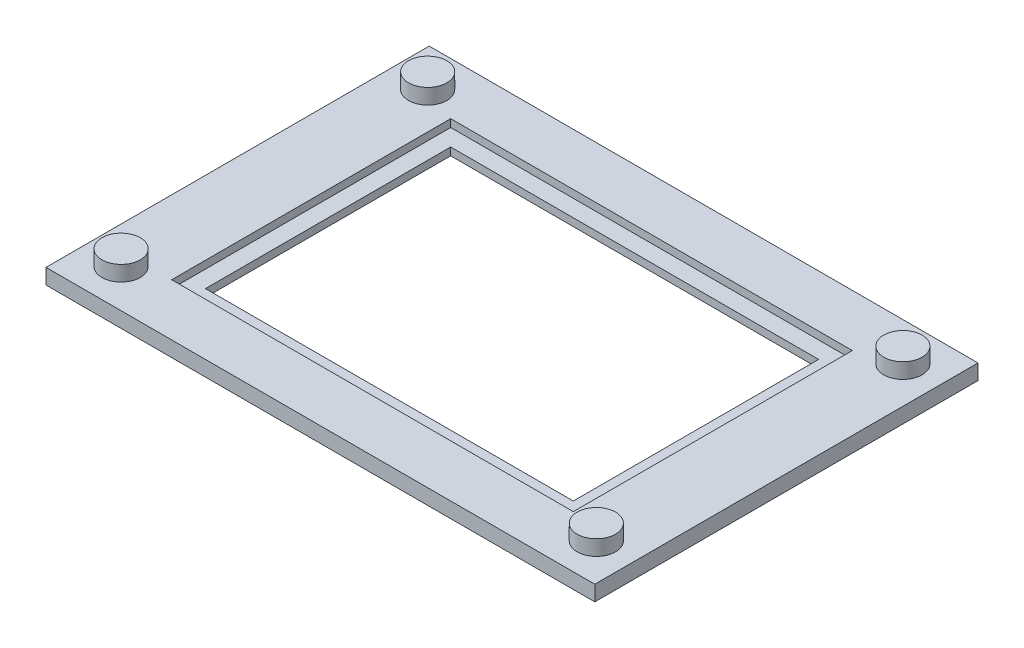
ISO-10303-21;
HEADER;
FILE_DESCRIPTION(('STEP AP214'),'2;1');
FILE_NAME('part.step','',(''),(''),'','','');
FILE_SCHEMA(('AUTOMOTIVE_DESIGN { 1 0 10303 214 1 1 1 1 }'));
ENDSEC;
DATA;
#1=APPLICATION_CONTEXT('core data for automotive mechanical design processes');
#2=APPLICATION_PROTOCOL_DEFINITION('international standard','automotive_design',2000,#1);
#3=PRODUCT_CONTEXT('',#1,'mechanical');
#4=PRODUCT('Part','Part','',(#3));
#5=PRODUCT_RELATED_PRODUCT_CATEGORY('part','',(#4));
#6=PRODUCT_DEFINITION_FORMATION('','',#4);
#7=PRODUCT_DEFINITION_CONTEXT('part definition',#1,'design');
#8=PRODUCT_DEFINITION('design','',#6,#7);
#9=PRODUCT_DEFINITION_SHAPE('','',#8);
#10=(LENGTH_UNIT() NAMED_UNIT(*) SI_UNIT(.MILLI.,.METRE.));
#11=(NAMED_UNIT(*) PLANE_ANGLE_UNIT() SI_UNIT($,.RADIAN.));
#12=(NAMED_UNIT(*) SI_UNIT($,.STERADIAN.) SOLID_ANGLE_UNIT());
#13=UNCERTAINTY_MEASURE_WITH_UNIT(LENGTH_MEASURE(1.E-05),#10,'distance_accuracy_value','');
#14=(GEOMETRIC_REPRESENTATION_CONTEXT(3) GLOBAL_UNCERTAINTY_ASSIGNED_CONTEXT((#13)) GLOBAL_UNIT_ASSIGNED_CONTEXT((#10,
#11,#12)) REPRESENTATION_CONTEXT('',''));
#15=CARTESIAN_POINT('',(0.,0.,0.));
#16=DIRECTION('',(0.,0.,1.));
#17=DIRECTION('',(1.,0.,0.));
#18=AXIS2_PLACEMENT_3D('',#15,#16,#17);
#19=CARTESIAN_POINT('',(0.,1.,0.));
#20=DIRECTION('',(0.,-1.,0.));
#21=DIRECTION('',(0.,0.,-1.));
#22=AXIS2_PLACEMENT_3D('',#19,#20,#21);
#23=PLANE('',#22);
#24=CARTESIAN_POINT('',(15.5,1.,-10.));
#25=DIRECTION('',(0.,-1.,0.));
#26=DIRECTION('',(0.,0.,-1.));
#27=AXIS2_PLACEMENT_3D('',#24,#25,#26);
#28=CIRCLE('',#27,1.25);
#29=CARTESIAN_POINT('',(15.5,1.,-11.25));
#30=VERTEX_POINT('',#29);
#31=EDGE_CURVE('E11',#30,#30,#28,.F.);
#32=ORIENTED_EDGE('',*,*,#31,.F.);
#33=EDGE_LOOP('',(#32));
#34=FACE_BOUND('',#33,.T.);
#35=CARTESIAN_POINT('',(15.5,1.,10.));
#36=DIRECTION('',(0.,-1.,0.));
#37=DIRECTION('',(0.,0.,-1.));
#38=AXIS2_PLACEMENT_3D('',#35,#36,#37);
#39=CIRCLE('',#38,1.25);
#40=CARTESIAN_POINT('',(15.5,1.,8.75));
#41=VERTEX_POINT('',#40);
#42=EDGE_CURVE('E48',#41,#41,#39,.F.);
#43=ORIENTED_EDGE('',*,*,#42,.F.);
#44=EDGE_LOOP('',(#43));
#45=FACE_BOUND('',#44,.T.);
#46=CARTESIAN_POINT('',(-15.5,1.,10.));
#47=DIRECTION('',(0.,-1.,0.));
#48=DIRECTION('',(0.,0.,-1.));
#49=AXIS2_PLACEMENT_3D('',#46,#47,#48);
#50=CIRCLE('',#49,1.25);
#51=CARTESIAN_POINT('',(-15.5,1.,8.75));
#52=VERTEX_POINT('',#51);
#53=EDGE_CURVE('E267',#52,#52,#50,.F.);
#54=ORIENTED_EDGE('',*,*,#53,.F.);
#55=EDGE_LOOP('',(#54));
#56=FACE_BOUND('',#55,.T.);
#57=CARTESIAN_POINT('',(-15.5,1.,-10.));
#58=DIRECTION('',(0.,-1.,0.));
#59=DIRECTION('',(0.,0.,-1.));
#60=AXIS2_PLACEMENT_3D('',#57,#58,#59);
#61=CIRCLE('',#60,1.25);
#62=CARTESIAN_POINT('',(-15.5,1.,-11.25));
#63=VERTEX_POINT('',#62);
#64=EDGE_CURVE('E263',#63,#63,#61,.F.);
#65=ORIENTED_EDGE('',*,*,#64,.F.);
#66=EDGE_LOOP('',(#65));
#67=FACE_BOUND('',#66,.T.);
#68=DIRECTION('',(-1.,0.,0.));
#69=VECTOR('',#68,1.);
#70=CARTESIAN_POINT('',(-13.1,1.,-9.1));
#71=LINE('',#70,#69);
#72=CARTESIAN_POINT('',(13.1,1.,-9.1));
#73=VERTEX_POINT('',#72);
#74=CARTESIAN_POINT('',(-13.1,1.,-9.1));
#75=VERTEX_POINT('',#74);
#76=EDGE_CURVE('E168',#73,#75,#71,.T.);
#77=ORIENTED_EDGE('',*,*,#76,.F.);
#78=DIRECTION('',(0.,0.,-1.));
#79=VECTOR('',#78,1.);
#80=CARTESIAN_POINT('',(13.1,1.,9.1));
#81=LINE('',#80,#79);
#82=CARTESIAN_POINT('',(13.1,1.,9.1));
#83=VERTEX_POINT('',#82);
#84=EDGE_CURVE('E55',#83,#73,#81,.T.);
#85=ORIENTED_EDGE('',*,*,#84,.F.);
#86=DIRECTION('',(1.,0.,0.));
#87=VECTOR('',#86,1.);
#88=CARTESIAN_POINT('',(-13.1,1.,9.1));
#89=LINE('',#88,#87);
#90=CARTESIAN_POINT('',(-13.1,1.,9.1));
#91=VERTEX_POINT('',#90);
#92=EDGE_CURVE('E152',#91,#83,#89,.T.);
#93=ORIENTED_EDGE('',*,*,#92,.F.);
#94=DIRECTION('',(0.,0.,1.));
#95=VECTOR('',#94,1.);
#96=CARTESIAN_POINT('',(-13.1,1.,9.1));
#97=LINE('',#96,#95);
#98=EDGE_CURVE('E156',#75,#91,#97,.T.);
#99=ORIENTED_EDGE('',*,*,#98,.F.);
#100=EDGE_LOOP('',(#77,#85,#93,#99));
#101=FACE_BOUND('',#100,.T.);
#102=DIRECTION('',(0.,0.,-1.));
#103=VECTOR('',#102,1.);
#104=CARTESIAN_POINT('',(17.9,1.,12.5));
#105=LINE('',#104,#103);
#106=CARTESIAN_POINT('',(17.9,1.,12.5));
#107=VERTEX_POINT('',#106);
#108=CARTESIAN_POINT('',(17.9,1.,-12.5));
#109=VERTEX_POINT('',#108);
#110=EDGE_CURVE('E219',#107,#109,#105,.T.);
#111=ORIENTED_EDGE('',*,*,#110,.T.);
#112=DIRECTION('',(-1.,0.,0.));
#113=VECTOR('',#112,1.);
#114=CARTESIAN_POINT('',(-17.9,1.,-12.5));
#115=LINE('',#114,#113);
#116=CARTESIAN_POINT('',(-17.9,1.,-12.5));
#117=VERTEX_POINT('',#116);
#118=EDGE_CURVE('E223',#109,#117,#115,.T.);
#119=ORIENTED_EDGE('',*,*,#118,.T.);
#120=DIRECTION('',(0.,0.,1.));
#121=VECTOR('',#120,1.);
#122=CARTESIAN_POINT('',(-17.9,1.,12.5));
#123=LINE('',#122,#121);
#124=CARTESIAN_POINT('',(-17.9,1.,12.5));
#125=VERTEX_POINT('',#124);
#126=EDGE_CURVE('E227',#117,#125,#123,.T.);
#127=ORIENTED_EDGE('',*,*,#126,.T.);
#128=DIRECTION('',(1.,0.,0.));
#129=VECTOR('',#128,1.);
#130=CARTESIAN_POINT('',(-17.9,1.,12.5));
#131=LINE('',#130,#129);
#132=EDGE_CURVE('E230',#125,#107,#131,.T.);
#133=ORIENTED_EDGE('',*,*,#132,.T.);
#134=EDGE_LOOP('',(#111,#119,#127,#133));
#135=FACE_BOUND('',#134,.T.);
#136=ADVANCED_FACE('F39',(#34,#45,#56,#67,#101,#135),#23,.F.);
#137=CARTESIAN_POINT('',(0.,0.,0.));
#138=DIRECTION('',(0.,-1.,0.));
#139=DIRECTION('',(0.,0.,-1.));
#140=AXIS2_PLACEMENT_3D('',#137,#138,#139);
#141=PLANE('',#140);
#142=DIRECTION('',(0.,0.,-1.));
#143=VECTOR('',#142,1.);
#144=CARTESIAN_POINT('',(17.9,0.,12.5));
#145=LINE('',#144,#143);
#146=CARTESIAN_POINT('',(17.9,0.,12.5));
#147=VERTEX_POINT('',#146);
#148=CARTESIAN_POINT('',(17.9,0.,-12.5));
#149=VERTEX_POINT('',#148);
#150=EDGE_CURVE('E218',#147,#149,#145,.T.);
#151=ORIENTED_EDGE('',*,*,#150,.F.);
#152=DIRECTION('',(1.,0.,0.));
#153=VECTOR('',#152,1.);
#154=CARTESIAN_POINT('',(-17.9,0.,12.5));
#155=LINE('',#154,#153);
#156=CARTESIAN_POINT('',(-17.9,0.,12.5));
#157=VERTEX_POINT('',#156);
#158=EDGE_CURVE('E224',#157,#147,#155,.T.);
#159=ORIENTED_EDGE('',*,*,#158,.F.);
#160=DIRECTION('',(0.,0.,1.));
#161=VECTOR('',#160,1.);
#162=CARTESIAN_POINT('',(-17.9,0.,12.5));
#163=LINE('',#162,#161);
#164=CARTESIAN_POINT('',(-17.9,0.,-12.5));
#165=VERTEX_POINT('',#164);
#166=EDGE_CURVE('E240',#165,#157,#163,.T.);
#167=ORIENTED_EDGE('',*,*,#166,.F.);
#168=DIRECTION('',(-1.,0.,0.));
#169=VECTOR('',#168,1.);
#170=CARTESIAN_POINT('',(-17.9,0.,-12.5));
#171=LINE('',#170,#169);
#172=EDGE_CURVE('E237',#149,#165,#171,.T.);
#173=ORIENTED_EDGE('',*,*,#172,.F.);
#174=EDGE_LOOP('',(#151,#159,#167,#173));
#175=FACE_BOUND('',#174,.T.);
#176=DIRECTION('',(1.,0.,0.));
#177=VECTOR('',#176,1.);
#178=CARTESIAN_POINT('',(-12.,0.,8.));
#179=LINE('',#178,#177);
#180=CARTESIAN_POINT('',(-12.,0.,8.));
#181=VERTEX_POINT('',#180);
#182=CARTESIAN_POINT('',(12.,0.,8.));
#183=VERTEX_POINT('',#182);
#184=EDGE_CURVE('E202',#181,#183,#179,.T.);
#185=ORIENTED_EDGE('',*,*,#184,.T.);
#186=DIRECTION('',(0.,0.,-1.));
#187=VECTOR('',#186,1.);
#188=CARTESIAN_POINT('',(12.,0.,8.));
#189=LINE('',#188,#187);
#190=CARTESIAN_POINT('',(12.,0.,-8.));
#191=VERTEX_POINT('',#190);
#192=EDGE_CURVE('E190',#183,#191,#189,.T.);
#193=ORIENTED_EDGE('',*,*,#192,.T.);
#194=DIRECTION('',(-1.,0.,0.));
#195=VECTOR('',#194,1.);
#196=CARTESIAN_POINT('',(-12.,0.,-8.));
#197=LINE('',#196,#195);
#198=CARTESIAN_POINT('',(-12.,0.,-8.));
#199=VERTEX_POINT('',#198);
#200=EDGE_CURVE('E194',#191,#199,#197,.T.);
#201=ORIENTED_EDGE('',*,*,#200,.T.);
#202=DIRECTION('',(0.,0.,1.));
#203=VECTOR('',#202,1.);
#204=CARTESIAN_POINT('',(-12.,0.,8.));
#205=LINE('',#204,#203);
#206=EDGE_CURVE('E198',#199,#181,#205,.T.);
#207=ORIENTED_EDGE('',*,*,#206,.T.);
#208=EDGE_LOOP('',(#185,#193,#201,#207));
#209=FACE_BOUND('',#208,.T.);
#210=ADVANCED_FACE('F278',(#175,#209),#141,.T.);
#211=CARTESIAN_POINT('',(17.9,1.,12.5));
#212=DIRECTION('',(-1.,0.,0.));
#213=DIRECTION('',(0.,0.,1.));
#214=AXIS2_PLACEMENT_3D('',#211,#212,#213);
#215=PLANE('',#214);
#216=ORIENTED_EDGE('',*,*,#150,.T.);
#217=DIRECTION('',(0.,-1.,0.));
#218=VECTOR('',#217,1.);
#219=CARTESIAN_POINT('',(17.9,1.,-12.5));
#220=LINE('',#219,#218);
#221=EDGE_CURVE('E256',#109,#149,#220,.T.);
#222=ORIENTED_EDGE('',*,*,#221,.F.);
#223=ORIENTED_EDGE('',*,*,#110,.F.);
#224=DIRECTION('',(0.,-1.,0.));
#225=VECTOR('',#224,1.);
#226=CARTESIAN_POINT('',(17.9,1.,12.5));
#227=LINE('',#226,#225);
#228=EDGE_CURVE('E233',#107,#147,#227,.T.);
#229=ORIENTED_EDGE('',*,*,#228,.T.);
#230=EDGE_LOOP('',(#216,#222,#223,#229));
#231=FACE_BOUND('',#230,.T.);
#232=ADVANCED_FACE('F41',(#231),#215,.F.);
#233=CARTESIAN_POINT('',(-17.9,1.,-12.5));
#234=DIRECTION('',(0.,0.,1.));
#235=DIRECTION('',(1.,0.,0.));
#236=AXIS2_PLACEMENT_3D('',#233,#234,#235);
#237=PLANE('',#236);
#238=ORIENTED_EDGE('',*,*,#172,.T.);
#239=DIRECTION('',(0.,-1.,0.));
#240=VECTOR('',#239,1.);
#241=CARTESIAN_POINT('',(-17.9,1.,-12.5));
#242=LINE('',#241,#240);
#243=EDGE_CURVE('E252',#117,#165,#242,.T.);
#244=ORIENTED_EDGE('',*,*,#243,.F.);
#245=ORIENTED_EDGE('',*,*,#118,.F.);
#246=ORIENTED_EDGE('',*,*,#221,.T.);
#247=EDGE_LOOP('',(#238,#244,#245,#246));
#248=FACE_BOUND('',#247,.T.);
#249=ADVANCED_FACE('F295',(#248),#237,.F.);
#250=CARTESIAN_POINT('',(-17.9,1.,12.5));
#251=DIRECTION('',(1.,0.,0.));
#252=DIRECTION('',(0.,0.,-1.));
#253=AXIS2_PLACEMENT_3D('',#250,#251,#252);
#254=PLANE('',#253);
#255=ORIENTED_EDGE('',*,*,#166,.T.);
#256=DIRECTION('',(0.,-1.,0.));
#257=VECTOR('',#256,1.);
#258=CARTESIAN_POINT('',(-17.9,1.,12.5));
#259=LINE('',#258,#257);
#260=EDGE_CURVE('E248',#125,#157,#259,.T.);
#261=ORIENTED_EDGE('',*,*,#260,.F.);
#262=ORIENTED_EDGE('',*,*,#126,.F.);
#263=ORIENTED_EDGE('',*,*,#243,.T.);
#264=EDGE_LOOP('',(#255,#261,#262,#263));
#265=FACE_BOUND('',#264,.T.);
#266=ADVANCED_FACE('F300',(#265),#254,.F.);
#267=CARTESIAN_POINT('',(-17.9,1.,12.5));
#268=DIRECTION('',(0.,0.,-1.));
#269=DIRECTION('',(-1.,0.,0.));
#270=AXIS2_PLACEMENT_3D('',#267,#268,#269);
#271=PLANE('',#270);
#272=ORIENTED_EDGE('',*,*,#158,.T.);
#273=ORIENTED_EDGE('',*,*,#228,.F.);
#274=ORIENTED_EDGE('',*,*,#132,.F.);
#275=ORIENTED_EDGE('',*,*,#260,.T.);
#276=EDGE_LOOP('',(#272,#273,#274,#275));
#277=FACE_BOUND('',#276,.T.);
#278=ADVANCED_FACE('F303',(#277),#271,.F.);
#279=CARTESIAN_POINT('',(12.,1.,8.));
#280=DIRECTION('',(-1.,0.,0.));
#281=DIRECTION('',(0.,0.,1.));
#282=AXIS2_PLACEMENT_3D('',#279,#280,#281);
#283=PLANE('',#282);
#284=DIRECTION('',(0.,0.,1.));
#285=VECTOR('',#284,1.);
#286=CARTESIAN_POINT('',(12.,0.5,8.));
#287=LINE('',#286,#285);
#288=CARTESIAN_POINT('',(12.,0.5,-8.));
#289=VERTEX_POINT('',#288);
#290=CARTESIAN_POINT('',(12.,0.5,8.));
#291=VERTEX_POINT('',#290);
#292=EDGE_CURVE('E63',#289,#291,#287,.T.);
#293=ORIENTED_EDGE('',*,*,#292,.F.);
#294=DIRECTION('',(0.,-1.,0.));
#295=VECTOR('',#294,1.);
#296=CARTESIAN_POINT('',(12.,1.,-8.));
#297=LINE('',#296,#295);
#298=EDGE_CURVE('E215',#289,#191,#297,.T.);
#299=ORIENTED_EDGE('',*,*,#298,.T.);
#300=ORIENTED_EDGE('',*,*,#192,.F.);
#301=DIRECTION('',(0.,-1.,0.));
#302=VECTOR('',#301,1.);
#303=CARTESIAN_POINT('',(12.,1.,8.));
#304=LINE('',#303,#302);
#305=EDGE_CURVE('E206',#291,#183,#304,.T.);
#306=ORIENTED_EDGE('',*,*,#305,.F.);
#307=EDGE_LOOP('',(#293,#299,#300,#306));
#308=FACE_BOUND('',#307,.T.);
#309=ADVANCED_FACE('F316',(#308),#283,.T.);
#310=CARTESIAN_POINT('',(-12.,1.,-8.));
#311=DIRECTION('',(0.,0.,1.));
#312=DIRECTION('',(1.,0.,0.));
#313=AXIS2_PLACEMENT_3D('',#310,#311,#312);
#314=PLANE('',#313);
#315=DIRECTION('',(1.,0.,0.));
#316=VECTOR('',#315,1.);
#317=CARTESIAN_POINT('',(-12.,0.5,-8.));
#318=LINE('',#317,#316);
#319=CARTESIAN_POINT('',(-12.,0.5,-8.));
#320=VERTEX_POINT('',#319);
#321=EDGE_CURVE('E185',#320,#289,#318,.T.);
#322=ORIENTED_EDGE('',*,*,#321,.F.);
#323=DIRECTION('',(0.,-1.,0.));
#324=VECTOR('',#323,1.);
#325=CARTESIAN_POINT('',(-12.,1.,-8.));
#326=LINE('',#325,#324);
#327=EDGE_CURVE('E212',#320,#199,#326,.T.);
#328=ORIENTED_EDGE('',*,*,#327,.T.);
#329=ORIENTED_EDGE('',*,*,#200,.F.);
#330=ORIENTED_EDGE('',*,*,#298,.F.);
#331=EDGE_LOOP('',(#322,#328,#329,#330));
#332=FACE_BOUND('',#331,.T.);
#333=ADVANCED_FACE('F321',(#332),#314,.T.);
#334=CARTESIAN_POINT('',(-12.,1.,8.));
#335=DIRECTION('',(1.,0.,0.));
#336=DIRECTION('',(0.,0.,-1.));
#337=AXIS2_PLACEMENT_3D('',#334,#335,#336);
#338=PLANE('',#337);
#339=DIRECTION('',(0.,0.,-1.));
#340=VECTOR('',#339,1.);
#341=CARTESIAN_POINT('',(-12.,0.5,8.));
#342=LINE('',#341,#340);
#343=CARTESIAN_POINT('',(-12.,0.5,8.));
#344=VERTEX_POINT('',#343);
#345=EDGE_CURVE('E177',#344,#320,#342,.T.);
#346=ORIENTED_EDGE('',*,*,#345,.F.);
#347=DIRECTION('',(0.,-1.,0.));
#348=VECTOR('',#347,1.);
#349=CARTESIAN_POINT('',(-12.,1.,8.));
#350=LINE('',#349,#348);
#351=EDGE_CURVE('E209',#344,#181,#350,.T.);
#352=ORIENTED_EDGE('',*,*,#351,.T.);
#353=ORIENTED_EDGE('',*,*,#206,.F.);
#354=ORIENTED_EDGE('',*,*,#327,.F.);
#355=EDGE_LOOP('',(#346,#352,#353,#354));
#356=FACE_BOUND('',#355,.T.);
#357=ADVANCED_FACE('F325',(#356),#338,.T.);
#358=CARTESIAN_POINT('',(-12.,1.,8.));
#359=DIRECTION('',(0.,0.,-1.));
#360=DIRECTION('',(-1.,0.,0.));
#361=AXIS2_PLACEMENT_3D('',#358,#359,#360);
#362=PLANE('',#361);
#363=DIRECTION('',(-1.,0.,0.));
#364=VECTOR('',#363,1.);
#365=CARTESIAN_POINT('',(-12.,0.5,8.));
#366=LINE('',#365,#364);
#367=EDGE_CURVE('E260',#291,#344,#366,.T.);
#368=ORIENTED_EDGE('',*,*,#367,.F.);
#369=ORIENTED_EDGE('',*,*,#305,.T.);
#370=ORIENTED_EDGE('',*,*,#184,.F.);
#371=ORIENTED_EDGE('',*,*,#351,.F.);
#372=EDGE_LOOP('',(#368,#369,#370,#371));
#373=FACE_BOUND('',#372,.T.);
#374=ADVANCED_FACE('F313',(#373),#362,.T.);
#375=CARTESIAN_POINT('',(13.1,0.5,9.1));
#376=DIRECTION('',(1.,0.,0.));
#377=DIRECTION('',(0.,0.,-1.));
#378=AXIS2_PLACEMENT_3D('',#375,#376,#377);
#379=PLANE('',#378);
#380=ORIENTED_EDGE('',*,*,#84,.T.);
#381=DIRECTION('',(0.,1.,0.));
#382=VECTOR('',#381,1.);
#383=CARTESIAN_POINT('',(13.1,0.5,-9.1));
#384=LINE('',#383,#382);
#385=CARTESIAN_POINT('',(13.1,0.5,-9.1));
#386=VERTEX_POINT('',#385);
#387=EDGE_CURVE('E127',#386,#73,#384,.T.);
#388=ORIENTED_EDGE('',*,*,#387,.F.);
#389=DIRECTION('',(0.,0.,-1.));
#390=VECTOR('',#389,1.);
#391=CARTESIAN_POINT('',(13.1,0.5,9.1));
#392=LINE('',#391,#390);
#393=CARTESIAN_POINT('',(13.1,0.5,9.1));
#394=VERTEX_POINT('',#393);
#395=EDGE_CURVE('E131',#394,#386,#392,.T.);
#396=ORIENTED_EDGE('',*,*,#395,.F.);
#397=DIRECTION('',(0.,1.,0.));
#398=VECTOR('',#397,1.);
#399=CARTESIAN_POINT('',(13.1,0.5,9.1));
#400=LINE('',#399,#398);
#401=EDGE_CURVE('E174',#394,#83,#400,.T.);
#402=ORIENTED_EDGE('',*,*,#401,.T.);
#403=EDGE_LOOP('',(#380,#388,#396,#402));
#404=FACE_BOUND('',#403,.T.);
#405=ADVANCED_FACE('F129',(#404),#379,.F.);
#406=CARTESIAN_POINT('',(-13.1,0.5,9.1));
#407=DIRECTION('',(0.,0.,1.));
#408=DIRECTION('',(1.,0.,0.));
#409=AXIS2_PLACEMENT_3D('',#406,#407,#408);
#410=PLANE('',#409);
#411=ORIENTED_EDGE('',*,*,#92,.T.);
#412=ORIENTED_EDGE('',*,*,#401,.F.);
#413=DIRECTION('',(1.,0.,0.));
#414=VECTOR('',#413,1.);
#415=CARTESIAN_POINT('',(-13.1,0.5,9.1));
#416=LINE('',#415,#414);
#417=CARTESIAN_POINT('',(-13.1,0.5,9.1));
#418=VERTEX_POINT('',#417);
#419=EDGE_CURVE('E138',#418,#394,#416,.T.);
#420=ORIENTED_EDGE('',*,*,#419,.F.);
#421=DIRECTION('',(0.,1.,0.));
#422=VECTOR('',#421,1.);
#423=CARTESIAN_POINT('',(-13.1,0.5,9.1));
#424=LINE('',#423,#422);
#425=EDGE_CURVE('E178',#418,#91,#424,.T.);
#426=ORIENTED_EDGE('',*,*,#425,.T.);
#427=EDGE_LOOP('',(#411,#412,#420,#426));
#428=FACE_BOUND('',#427,.T.);
#429=ADVANCED_FACE('F340',(#428),#410,.F.);
#430=CARTESIAN_POINT('',(-13.1,0.5,9.1));
#431=DIRECTION('',(-1.,0.,0.));
#432=DIRECTION('',(0.,0.,1.));
#433=AXIS2_PLACEMENT_3D('',#430,#431,#432);
#434=PLANE('',#433);
#435=ORIENTED_EDGE('',*,*,#98,.T.);
#436=ORIENTED_EDGE('',*,*,#425,.F.);
#437=DIRECTION('',(0.,0.,1.));
#438=VECTOR('',#437,1.);
#439=CARTESIAN_POINT('',(-13.1,0.5,9.1));
#440=LINE('',#439,#438);
#441=CARTESIAN_POINT('',(-13.1,0.5,-9.1));
#442=VERTEX_POINT('',#441);
#443=EDGE_CURVE('E147',#442,#418,#440,.T.);
#444=ORIENTED_EDGE('',*,*,#443,.F.);
#445=DIRECTION('',(0.,1.,0.));
#446=VECTOR('',#445,1.);
#447=CARTESIAN_POINT('',(-13.1,0.5,-9.1));
#448=LINE('',#447,#446);
#449=EDGE_CURVE('E137',#442,#75,#448,.T.);
#450=ORIENTED_EDGE('',*,*,#449,.T.);
#451=EDGE_LOOP('',(#435,#436,#444,#450));
#452=FACE_BOUND('',#451,.T.);
#453=ADVANCED_FACE('F336',(#452),#434,.F.);
#454=CARTESIAN_POINT('',(-13.1,0.5,-9.1));
#455=DIRECTION('',(0.,0.,-1.));
#456=DIRECTION('',(-1.,0.,0.));
#457=AXIS2_PLACEMENT_3D('',#454,#455,#456);
#458=PLANE('',#457);
#459=ORIENTED_EDGE('',*,*,#76,.T.);
#460=ORIENTED_EDGE('',*,*,#449,.F.);
#461=DIRECTION('',(-1.,0.,0.));
#462=VECTOR('',#461,1.);
#463=CARTESIAN_POINT('',(-13.1,0.5,-9.1));
#464=LINE('',#463,#462);
#465=EDGE_CURVE('E141',#386,#442,#464,.T.);
#466=ORIENTED_EDGE('',*,*,#465,.F.);
#467=ORIENTED_EDGE('',*,*,#387,.T.);
#468=EDGE_LOOP('',(#459,#460,#466,#467));
#469=FACE_BOUND('',#468,.T.);
#470=ADVANCED_FACE('F142',(#469),#458,.F.);
#471=CARTESIAN_POINT('',(0.,0.5,0.));
#472=DIRECTION('',(0.,-1.,0.));
#473=DIRECTION('',(0.,0.,-1.));
#474=AXIS2_PLACEMENT_3D('',#471,#472,#473);
#475=PLANE('',#474);
#476=ORIENTED_EDGE('',*,*,#292,.T.);
#477=ORIENTED_EDGE('',*,*,#367,.T.);
#478=ORIENTED_EDGE('',*,*,#345,.T.);
#479=ORIENTED_EDGE('',*,*,#321,.T.);
#480=EDGE_LOOP('',(#476,#477,#478,#479));
#481=FACE_BOUND('',#480,.T.);
#482=ORIENTED_EDGE('',*,*,#395,.T.);
#483=ORIENTED_EDGE('',*,*,#465,.T.);
#484=ORIENTED_EDGE('',*,*,#443,.T.);
#485=ORIENTED_EDGE('',*,*,#419,.T.);
#486=EDGE_LOOP('',(#482,#483,#484,#485));
#487=FACE_BOUND('',#486,.T.);
#488=ADVANCED_FACE('F149',(#481,#487),#475,.F.);
#489=CARTESIAN_POINT('',(-15.5,2.,-10.));
#490=DIRECTION('',(0.,-1.,0.));
#491=DIRECTION('',(0.,0.,-1.));
#492=AXIS2_PLACEMENT_3D('',#489,#490,#491);
#493=CYLINDRICAL_SURFACE('',#492,1.25);
#494=CARTESIAN_POINT('',(-15.5,2.,-10.));
#495=DIRECTION('',(0.,1.,0.));
#496=DIRECTION('',(0.,0.,1.));
#497=AXIS2_PLACEMENT_3D('',#494,#495,#496);
#498=CIRCLE('',#497,1.25);
#499=CARTESIAN_POINT('',(-15.5,2.,-8.75));
#500=VERTEX_POINT('',#499);
#501=EDGE_CURVE('E159',#500,#500,#498,.T.);
#502=ORIENTED_EDGE('',*,*,#501,.F.);
#503=EDGE_LOOP('',(#502));
#504=FACE_BOUND('',#503,.T.);
#505=ORIENTED_EDGE('',*,*,#64,.T.);
#506=EDGE_LOOP('',(#505));
#507=FACE_BOUND('',#506,.T.);
#508=ADVANCED_FACE('F327',(#504,#507),#493,.T.);
#509=CARTESIAN_POINT('',(-15.5,2.,-10.));
#510=DIRECTION('',(0.,1.,0.));
#511=DIRECTION('',(0.,0.,1.));
#512=AXIS2_PLACEMENT_3D('',#509,#510,#511);
#513=PLANE('',#512);
#514=ORIENTED_EDGE('',*,*,#501,.T.);
#515=EDGE_LOOP('',(#514));
#516=FACE_BOUND('',#515,.T.);
#517=ADVANCED_FACE('F333',(#516),#513,.T.);
#518=CARTESIAN_POINT('',(-15.5,2.,10.));
#519=DIRECTION('',(0.,-1.,0.));
#520=DIRECTION('',(0.,0.,-1.));
#521=AXIS2_PLACEMENT_3D('',#518,#519,#520);
#522=CYLINDRICAL_SURFACE('',#521,1.25);
#523=CARTESIAN_POINT('',(-15.5,2.,10.));
#524=DIRECTION('',(0.,1.,0.));
#525=DIRECTION('',(0.,0.,1.));
#526=AXIS2_PLACEMENT_3D('',#523,#524,#525);
#527=CIRCLE('',#526,1.25);
#528=CARTESIAN_POINT('',(-15.5,2.,11.25));
#529=VERTEX_POINT('',#528);
#530=EDGE_CURVE('E462',#529,#529,#527,.T.);
#531=ORIENTED_EDGE('',*,*,#530,.F.);
#532=EDGE_LOOP('',(#531));
#533=FACE_BOUND('',#532,.T.);
#534=ORIENTED_EDGE('',*,*,#53,.T.);
#535=EDGE_LOOP('',(#534));
#536=FACE_BOUND('',#535,.T.);
#537=ADVANCED_FACE('F392',(#533,#536),#522,.T.);
#538=CARTESIAN_POINT('',(-15.5,2.,10.));
#539=DIRECTION('',(0.,1.,0.));
#540=DIRECTION('',(0.,0.,1.));
#541=AXIS2_PLACEMENT_3D('',#538,#539,#540);
#542=PLANE('',#541);
#543=ORIENTED_EDGE('',*,*,#530,.T.);
#544=EDGE_LOOP('',(#543));
#545=FACE_BOUND('',#544,.T.);
#546=ADVANCED_FACE('F401',(#545),#542,.T.);
#547=CARTESIAN_POINT('',(15.5,2.,10.));
#548=DIRECTION('',(0.,-1.,0.));
#549=DIRECTION('',(0.,0.,-1.));
#550=AXIS2_PLACEMENT_3D('',#547,#548,#549);
#551=CYLINDRICAL_SURFACE('',#550,1.25);
#552=CARTESIAN_POINT('',(15.5,2.,10.));
#553=DIRECTION('',(0.,1.,0.));
#554=DIRECTION('',(0.,0.,1.));
#555=AXIS2_PLACEMENT_3D('',#552,#553,#554);
#556=CIRCLE('',#555,1.25);
#557=CARTESIAN_POINT('',(15.5,2.,11.25));
#558=VERTEX_POINT('',#557);
#559=EDGE_CURVE('E458',#558,#558,#556,.T.);
#560=ORIENTED_EDGE('',*,*,#559,.F.);
#561=EDGE_LOOP('',(#560));
#562=FACE_BOUND('',#561,.T.);
#563=ORIENTED_EDGE('',*,*,#42,.T.);
#564=EDGE_LOOP('',(#563));
#565=FACE_BOUND('',#564,.T.);
#566=ADVANCED_FACE('F274',(#562,#565),#551,.T.);
#567=CARTESIAN_POINT('',(15.5,2.,10.));
#568=DIRECTION('',(0.,1.,0.));
#569=DIRECTION('',(0.,0.,1.));
#570=AXIS2_PLACEMENT_3D('',#567,#568,#569);
#571=PLANE('',#570);
#572=ORIENTED_EDGE('',*,*,#559,.T.);
#573=EDGE_LOOP('',(#572));
#574=FACE_BOUND('',#573,.T.);
#575=ADVANCED_FACE('F420',(#574),#571,.T.);
#576=CARTESIAN_POINT('',(15.5,2.,-10.));
#577=DIRECTION('',(0.,-1.,0.));
#578=DIRECTION('',(0.,0.,-1.));
#579=AXIS2_PLACEMENT_3D('',#576,#577,#578);
#580=CYLINDRICAL_SURFACE('',#579,1.25);
#581=CARTESIAN_POINT('',(15.5,2.,-10.));
#582=DIRECTION('',(0.,1.,0.));
#583=DIRECTION('',(0.,0.,1.));
#584=AXIS2_PLACEMENT_3D('',#581,#582,#583);
#585=CIRCLE('',#584,1.25);
#586=CARTESIAN_POINT('',(15.5,2.,-8.75));
#587=VERTEX_POINT('',#586);
#588=EDGE_CURVE('E456',#587,#587,#585,.T.);
#589=ORIENTED_EDGE('',*,*,#588,.F.);
#590=EDGE_LOOP('',(#589));
#591=FACE_BOUND('',#590,.T.);
#592=ORIENTED_EDGE('',*,*,#31,.T.);
#593=EDGE_LOOP('',(#592));
#594=FACE_BOUND('',#593,.T.);
#595=ADVANCED_FACE('F430',(#591,#594),#580,.T.);
#596=CARTESIAN_POINT('',(15.5,2.,-10.));
#597=DIRECTION('',(0.,1.,0.));
#598=DIRECTION('',(0.,0.,1.));
#599=AXIS2_PLACEMENT_3D('',#596,#597,#598);
#600=PLANE('',#599);
#601=ORIENTED_EDGE('',*,*,#588,.T.);
#602=EDGE_LOOP('',(#601));
#603=FACE_BOUND('',#602,.T.);
#604=ADVANCED_FACE('F440',(#603),#600,.T.);
#605=CLOSED_SHELL('',(#136,#210,#232,#249,#266,#278,#309,#333,#357,#374,#405,#429,#453,#470,
#488,#508,#517,#537,#546,#566,#575,#595,#604));
#606=MANIFOLD_SOLID_BREP('B2',#605);
#607=ADVANCED_BREP_SHAPE_REPRESENTATION('',(#18,#606),#14);
#608=SHAPE_DEFINITION_REPRESENTATION(#9,#607);
ENDSEC;
END-ISO-10303-21;
